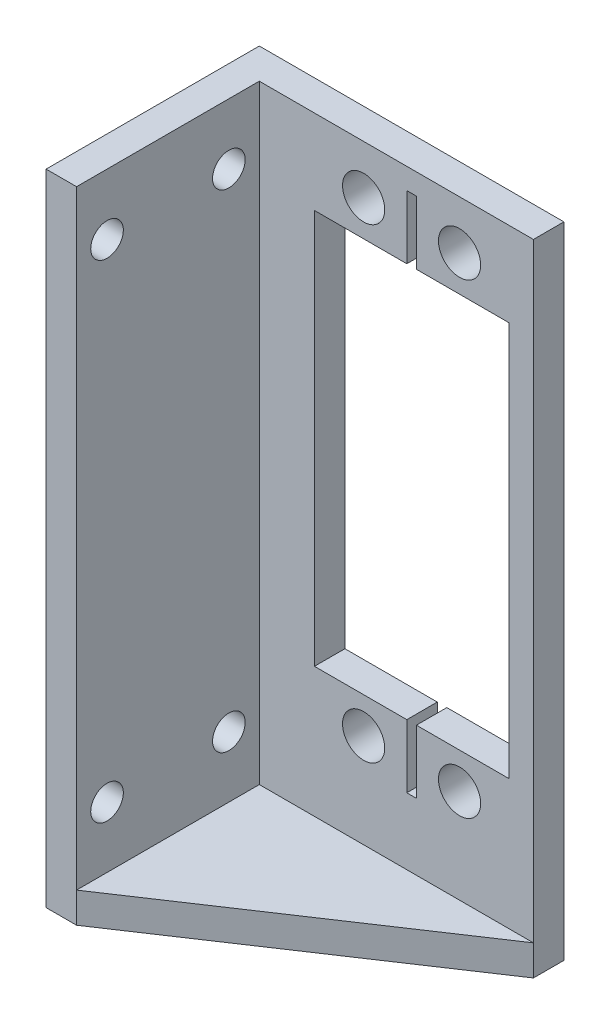
ISO-10303-21;
HEADER;
FILE_DESCRIPTION(('STEP AP214'),'2;1');
FILE_NAME('part.step','',(''),(''),'','','');
FILE_SCHEMA(('AUTOMOTIVE_DESIGN { 1 0 10303 214 1 1 1 1 }'));
ENDSEC;
DATA;
#1=APPLICATION_CONTEXT('core data for automotive mechanical design processes');
#2=APPLICATION_PROTOCOL_DEFINITION('international standard','automotive_design',2000,#1);
#3=PRODUCT_CONTEXT('',#1,'mechanical');
#4=PRODUCT('Part','Part','',(#3));
#5=PRODUCT_RELATED_PRODUCT_CATEGORY('part','',(#4));
#6=PRODUCT_DEFINITION_FORMATION('','',#4);
#7=PRODUCT_DEFINITION_CONTEXT('part definition',#1,'design');
#8=PRODUCT_DEFINITION('design','',#6,#7);
#9=PRODUCT_DEFINITION_SHAPE('','',#8);
#10=(LENGTH_UNIT() NAMED_UNIT(*) SI_UNIT(.MILLI.,.METRE.));
#11=(NAMED_UNIT(*) PLANE_ANGLE_UNIT() SI_UNIT($,.RADIAN.));
#12=(NAMED_UNIT(*) SI_UNIT($,.STERADIAN.) SOLID_ANGLE_UNIT());
#13=UNCERTAINTY_MEASURE_WITH_UNIT(LENGTH_MEASURE(1.E-05),#10,'distance_accuracy_value','');
#14=(GEOMETRIC_REPRESENTATION_CONTEXT(3) GLOBAL_UNCERTAINTY_ASSIGNED_CONTEXT((#13)) GLOBAL_UNIT_ASSIGNED_CONTEXT((#10,
#11,#12)) REPRESENTATION_CONTEXT('',''));
#15=CARTESIAN_POINT('',(0.,0.,0.));
#16=DIRECTION('',(0.,0.,1.));
#17=DIRECTION('',(1.,0.,0.));
#18=AXIS2_PLACEMENT_3D('',#15,#16,#17);
#19=CARTESIAN_POINT('',(31.75,0.,-3.175));
#20=DIRECTION('',(-1.,0.,0.));
#21=DIRECTION('',(0.,-1.,0.));
#22=AXIS2_PLACEMENT_3D('',#19,#20,#21);
#23=PLANE('',#22);
#24=DIRECTION('',(0.,1.,0.));
#25=VECTOR('',#24,1.);
#26=CARTESIAN_POINT('',(31.75,0.,0.));
#27=LINE('',#26,#25);
#28=CARTESIAN_POINT('',(31.75,0.,0.));
#29=VERTEX_POINT('',#28);
#30=CARTESIAN_POINT('',(31.75,63.5,0.));
#31=VERTEX_POINT('',#30);
#32=EDGE_CURVE('E349',#29,#31,#27,.T.);
#33=ORIENTED_EDGE('',*,*,#32,.F.);
#34=DIRECTION('',(0.,1.,0.));
#35=VECTOR('',#34,1.);
#36=CARTESIAN_POINT('',(31.75,-3.175,0.));
#37=LINE('',#36,#35);
#38=CARTESIAN_POINT('',(31.75,-3.175,0.));
#39=VERTEX_POINT('',#38);
#40=EDGE_CURVE('E208',#39,#29,#37,.T.);
#41=ORIENTED_EDGE('',*,*,#40,.F.);
#42=DIRECTION('',(0.,0.,-1.));
#43=VECTOR('',#42,1.);
#44=CARTESIAN_POINT('',(31.75,-3.175,-3.175));
#45=LINE('',#44,#43);
#46=CARTESIAN_POINT('',(31.75,-3.175,-3.175));
#47=VERTEX_POINT('',#46);
#48=EDGE_CURVE('E204',#39,#47,#45,.T.);
#49=ORIENTED_EDGE('',*,*,#48,.T.);
#50=DIRECTION('',(0.,1.,0.));
#51=VECTOR('',#50,1.);
#52=CARTESIAN_POINT('',(31.75,0.,-3.175));
#53=LINE('',#52,#51);
#54=CARTESIAN_POINT('',(31.75,63.5,-3.175));
#55=VERTEX_POINT('',#54);
#56=EDGE_CURVE('E340',#47,#55,#53,.T.);
#57=ORIENTED_EDGE('',*,*,#56,.T.);
#58=DIRECTION('',(0.,0.,1.));
#59=VECTOR('',#58,1.);
#60=CARTESIAN_POINT('',(31.75,63.5,-3.175));
#61=LINE('',#60,#59);
#62=EDGE_CURVE('E11',#55,#31,#61,.T.);
#63=ORIENTED_EDGE('',*,*,#62,.T.);
#64=EDGE_LOOP('',(#33,#41,#49,#57,#63));
#65=FACE_BOUND('',#64,.T.);
#66=ADVANCED_FACE('F39',(#65),#23,.F.);
#67=CARTESIAN_POINT('',(0.,63.5,-3.175));
#68=DIRECTION('',(0.,1.,0.));
#69=DIRECTION('',(0.,0.,-1.));
#70=AXIS2_PLACEMENT_3D('',#67,#68,#69);
#71=PLANE('',#70);
#72=DIRECTION('',(1.,0.,0.));
#73=VECTOR('',#72,1.);
#74=CARTESIAN_POINT('',(0.,63.5,0.));
#75=LINE('',#74,#73);
#76=CARTESIAN_POINT('',(3.175,63.5,0.));
#77=VERTEX_POINT('',#76);
#78=EDGE_CURVE('E344',#77,#31,#75,.T.);
#79=ORIENTED_EDGE('',*,*,#78,.T.);
#80=ORIENTED_EDGE('',*,*,#62,.F.);
#81=DIRECTION('',(1.,0.,0.));
#82=VECTOR('',#81,1.);
#83=CARTESIAN_POINT('',(0.,63.5,-3.175));
#84=LINE('',#83,#82);
#85=CARTESIAN_POINT('',(0.,63.5,-3.175));
#86=VERTEX_POINT('',#85);
#87=EDGE_CURVE('E343',#86,#55,#84,.T.);
#88=ORIENTED_EDGE('',*,*,#87,.F.);
#89=DIRECTION('',(0.,0.,1.));
#90=VECTOR('',#89,1.);
#91=CARTESIAN_POINT('',(0.,63.5,-3.175));
#92=LINE('',#91,#90);
#93=CARTESIAN_POINT('',(0.,63.5,19.05));
#94=VERTEX_POINT('',#93);
#95=EDGE_CURVE('E46',#86,#94,#92,.T.);
#96=ORIENTED_EDGE('',*,*,#95,.T.);
#97=DIRECTION('',(-1.,0.,0.));
#98=VECTOR('',#97,1.);
#99=CARTESIAN_POINT('',(0.,63.5,19.05));
#100=LINE('',#99,#98);
#101=CARTESIAN_POINT('',(3.175,63.5,19.05));
#102=VERTEX_POINT('',#101);
#103=EDGE_CURVE('E187',#102,#94,#100,.T.);
#104=ORIENTED_EDGE('',*,*,#103,.F.);
#105=DIRECTION('',(0.,0.,-1.));
#106=VECTOR('',#105,1.);
#107=CARTESIAN_POINT('',(3.175,63.5,19.05));
#108=LINE('',#107,#106);
#109=EDGE_CURVE('E218',#102,#77,#108,.T.);
#110=ORIENTED_EDGE('',*,*,#109,.T.);
#111=EDGE_LOOP('',(#79,#80,#88,#96,#104,#110));
#112=FACE_BOUND('',#111,.T.);
#113=ADVANCED_FACE('F354',(#112),#71,.T.);
#114=CARTESIAN_POINT('',(0.,0.,-3.175));
#115=DIRECTION('',(-1.,0.,0.));
#116=DIRECTION('',(0.,-1.,0.));
#117=AXIS2_PLACEMENT_3D('',#114,#115,#116);
#118=PLANE('',#117);
#119=CARTESIAN_POINT('',(0.,6.35,3.175));
#120=DIRECTION('',(-1.,0.,0.));
#121=DIRECTION('',(0.,1.,0.));
#122=AXIS2_PLACEMENT_3D('',#119,#120,#121);
#123=CIRCLE('',#122,1.700000029);
#124=CARTESIAN_POINT('',(0.,8.050000029,3.175));
#125=VERTEX_POINT('',#124);
#126=EDGE_CURVE('E402',#125,#125,#123,.T.);
#127=ORIENTED_EDGE('',*,*,#126,.F.);
#128=EDGE_LOOP('',(#127));
#129=FACE_BOUND('',#128,.T.);
#130=CARTESIAN_POINT('',(0.,57.15,15.875));
#131=DIRECTION('',(-1.,0.,0.));
#132=DIRECTION('',(0.,1.,0.));
#133=AXIS2_PLACEMENT_3D('',#130,#131,#132);
#134=CIRCLE('',#133,1.700000029);
#135=CARTESIAN_POINT('',(0.,58.850000029,15.875));
#136=VERTEX_POINT('',#135);
#137=EDGE_CURVE('E406',#136,#136,#134,.T.);
#138=ORIENTED_EDGE('',*,*,#137,.F.);
#139=EDGE_LOOP('',(#138));
#140=FACE_BOUND('',#139,.T.);
#141=CARTESIAN_POINT('',(0.,6.35,15.875));
#142=DIRECTION('',(-1.,0.,0.));
#143=DIRECTION('',(0.,1.,0.));
#144=AXIS2_PLACEMENT_3D('',#141,#142,#143);
#145=CIRCLE('',#144,1.700000029);
#146=CARTESIAN_POINT('',(0.,8.050000029,15.875));
#147=VERTEX_POINT('',#146);
#148=EDGE_CURVE('E410',#147,#147,#145,.T.);
#149=ORIENTED_EDGE('',*,*,#148,.F.);
#150=EDGE_LOOP('',(#149));
#151=FACE_BOUND('',#150,.T.);
#152=CARTESIAN_POINT('',(0.,57.15,3.175));
#153=DIRECTION('',(-1.,0.,0.));
#154=DIRECTION('',(0.,1.,0.));
#155=AXIS2_PLACEMENT_3D('',#152,#153,#154);
#156=CIRCLE('',#155,1.700000029);
#157=CARTESIAN_POINT('',(0.,58.850000029,3.175));
#158=VERTEX_POINT('',#157);
#159=EDGE_CURVE('E197',#158,#158,#156,.T.);
#160=ORIENTED_EDGE('',*,*,#159,.F.);
#161=EDGE_LOOP('',(#160));
#162=FACE_BOUND('',#161,.T.);
#163=ORIENTED_EDGE('',*,*,#95,.F.);
#164=DIRECTION('',(0.,1.,0.));
#165=VECTOR('',#164,1.);
#166=CARTESIAN_POINT('',(0.,0.,-3.175));
#167=LINE('',#166,#165);
#168=CARTESIAN_POINT('',(0.,-3.175,-3.175));
#169=VERTEX_POINT('',#168);
#170=EDGE_CURVE('E194',#169,#86,#167,.T.);
#171=ORIENTED_EDGE('',*,*,#170,.F.);
#172=DIRECTION('',(0.,0.,1.));
#173=VECTOR('',#172,1.);
#174=CARTESIAN_POINT('',(0.,-3.175,19.05));
#175=LINE('',#174,#173);
#176=CARTESIAN_POINT('',(0.,-3.175,19.05));
#177=VERTEX_POINT('',#176);
#178=EDGE_CURVE('E175',#169,#177,#175,.T.);
#179=ORIENTED_EDGE('',*,*,#178,.T.);
#180=DIRECTION('',(0.,-1.,0.));
#181=VECTOR('',#180,1.);
#182=CARTESIAN_POINT('',(0.,0.,19.05));
#183=LINE('',#182,#181);
#184=EDGE_CURVE('E184',#94,#177,#183,.T.);
#185=ORIENTED_EDGE('',*,*,#184,.F.);
#186=EDGE_LOOP('',(#163,#171,#179,#185));
#187=FACE_BOUND('',#186,.T.);
#188=ADVANCED_FACE('F193',(#129,#140,#151,#162,#187),#118,.T.);
#189=CARTESIAN_POINT('',(0.,0.,-3.175));
#190=DIRECTION('',(0.,0.,-1.));
#191=DIRECTION('',(1.,0.,0.));
#192=AXIS2_PLACEMENT_3D('',#189,#190,#191);
#193=PLANE('',#192);
#194=CARTESIAN_POINT('',(24.050000033,9.82700003100002,-3.175));
#195=DIRECTION('',(0.,0.,1.));
#196=DIRECTION('',(1.,0.,0.));
#197=AXIS2_PLACEMENT_3D('',#194,#195,#196);
#198=CIRCLE('',#197,2.200000045);
#199=CARTESIAN_POINT('',(26.250000078,9.82700003100002,-3.175));
#200=VERTEX_POINT('',#199);
#201=EDGE_CURVE('E322',#200,#200,#198,.T.);
#202=ORIENTED_EDGE('',*,*,#201,.T.);
#203=EDGE_LOOP('',(#202));
#204=FACE_BOUND('',#203,.T.);
#205=CARTESIAN_POINT('',(14.049999967,58.427000113,-3.175));
#206=DIRECTION('',(0.,0.,1.));
#207=DIRECTION('',(1.,0.,0.));
#208=AXIS2_PLACEMENT_3D('',#205,#206,#207);
#209=CIRCLE('',#208,2.200000045);
#210=CARTESIAN_POINT('',(16.250000012,58.427000113,-3.175));
#211=VERTEX_POINT('',#210);
#212=EDGE_CURVE('E329',#211,#211,#209,.T.);
#213=ORIENTED_EDGE('',*,*,#212,.T.);
#214=EDGE_LOOP('',(#213));
#215=FACE_BOUND('',#214,.T.);
#216=DIRECTION('',(0.,-1.,0.));
#217=VECTOR('',#216,1.);
#218=CARTESIAN_POINT('',(8.923000061,54.704000066,-3.175));
#219=LINE('',#218,#217);
#220=CARTESIAN_POINT('',(8.923000061,54.704000066,-3.175));
#221=VERTEX_POINT('',#220);
#222=CARTESIAN_POINT('',(8.923000061,13.550000078,-3.175));
#223=VERTEX_POINT('',#222);
#224=EDGE_CURVE('E279',#221,#223,#219,.T.);
#225=ORIENTED_EDGE('',*,*,#224,.T.);
#226=DIRECTION('',(1.,0.,0.));
#227=VECTOR('',#226,1.);
#228=CARTESIAN_POINT('',(8.923000061,13.550000078,-3.175));
#229=LINE('',#228,#227);
#230=CARTESIAN_POINT('',(18.55,13.550000078,-3.175));
#231=VERTEX_POINT('',#230);
#232=EDGE_CURVE('E276',#223,#231,#229,.T.);
#233=ORIENTED_EDGE('',*,*,#232,.T.);
#234=DIRECTION('',(0.,-1.,0.));
#235=VECTOR('',#234,1.);
#236=CARTESIAN_POINT('',(18.55,13.550000078,-3.175));
#237=LINE('',#236,#235);
#238=CARTESIAN_POINT('',(18.55,6.94600007800004,-3.175));
#239=VERTEX_POINT('',#238);
#240=EDGE_CURVE('E273',#231,#239,#237,.T.);
#241=ORIENTED_EDGE('',*,*,#240,.T.);
#242=DIRECTION('',(1.,0.,0.));
#243=VECTOR('',#242,1.);
#244=CARTESIAN_POINT('',(18.55,6.94600007800004,-3.175));
#245=LINE('',#244,#243);
#246=CARTESIAN_POINT('',(19.55,6.94600007800001,-3.175));
#247=VERTEX_POINT('',#246);
#248=EDGE_CURVE('E270',#239,#247,#245,.T.);
#249=ORIENTED_EDGE('',*,*,#248,.T.);
#250=DIRECTION('',(0.,1.,0.));
#251=VECTOR('',#250,1.);
#252=CARTESIAN_POINT('',(19.55,13.550000078,-3.175));
#253=LINE('',#252,#251);
#254=CARTESIAN_POINT('',(19.55,13.550000078,-3.175));
#255=VERTEX_POINT('',#254);
#256=EDGE_CURVE('E267',#247,#255,#253,.T.);
#257=ORIENTED_EDGE('',*,*,#256,.T.);
#258=DIRECTION('',(1.,0.,0.));
#259=VECTOR('',#258,1.);
#260=CARTESIAN_POINT('',(19.55,13.550000078,-3.175));
#261=LINE('',#260,#259);
#262=CARTESIAN_POINT('',(29.176999939,13.550000078,-3.175));
#263=VERTEX_POINT('',#262);
#264=EDGE_CURVE('E264',#255,#263,#261,.T.);
#265=ORIENTED_EDGE('',*,*,#264,.T.);
#266=DIRECTION('',(0.,1.,0.));
#267=VECTOR('',#266,1.);
#268=CARTESIAN_POINT('',(29.176999939,54.704000066,-3.175));
#269=LINE('',#268,#267);
#270=CARTESIAN_POINT('',(29.176999939,54.704000066,-3.175));
#271=VERTEX_POINT('',#270);
#272=EDGE_CURVE('E261',#263,#271,#269,.T.);
#273=ORIENTED_EDGE('',*,*,#272,.T.);
#274=DIRECTION('',(-1.,0.,0.));
#275=VECTOR('',#274,1.);
#276=CARTESIAN_POINT('',(19.55,54.704000066,-3.175));
#277=LINE('',#276,#275);
#278=CARTESIAN_POINT('',(19.55,54.704000066,-3.175));
#279=VERTEX_POINT('',#278);
#280=EDGE_CURVE('E258',#271,#279,#277,.T.);
#281=ORIENTED_EDGE('',*,*,#280,.T.);
#282=DIRECTION('',(0.,1.,0.));
#283=VECTOR('',#282,1.);
#284=CARTESIAN_POINT('',(19.55,54.704000066,-3.175));
#285=LINE('',#284,#283);
#286=CARTESIAN_POINT('',(19.55,61.308000066,-3.175));
#287=VERTEX_POINT('',#286);
#288=EDGE_CURVE('E255',#279,#287,#285,.T.);
#289=ORIENTED_EDGE('',*,*,#288,.T.);
#290=DIRECTION('',(-1.,0.,0.));
#291=VECTOR('',#290,1.);
#292=CARTESIAN_POINT('',(18.55,61.308000066,-3.175));
#293=LINE('',#292,#291);
#294=CARTESIAN_POINT('',(18.55,61.308000066,-3.175));
#295=VERTEX_POINT('',#294);
#296=EDGE_CURVE('E252',#287,#295,#293,.T.);
#297=ORIENTED_EDGE('',*,*,#296,.T.);
#298=DIRECTION('',(0.,-1.,0.));
#299=VECTOR('',#298,1.);
#300=CARTESIAN_POINT('',(18.55,54.704000066,-3.175));
#301=LINE('',#300,#299);
#302=CARTESIAN_POINT('',(18.55,54.704000066,-3.175));
#303=VERTEX_POINT('',#302);
#304=EDGE_CURVE('E248',#295,#303,#301,.T.);
#305=ORIENTED_EDGE('',*,*,#304,.T.);
#306=DIRECTION('',(-1.,0.,0.));
#307=VECTOR('',#306,1.);
#308=CARTESIAN_POINT('',(8.923000061,54.704000066,-3.175));
#309=LINE('',#308,#307);
#310=EDGE_CURVE('E245',#303,#221,#309,.T.);
#311=ORIENTED_EDGE('',*,*,#310,.T.);
#312=EDGE_LOOP('',(#225,#233,#241,#249,#257,#265,#273,#281,#289,#297,#305,#311));
#313=FACE_BOUND('',#312,.T.);
#314=CARTESIAN_POINT('',(24.050000033,58.427000113,-3.175));
#315=DIRECTION('',(0.,0.,1.));
#316=DIRECTION('',(1.,0.,0.));
#317=AXIS2_PLACEMENT_3D('',#314,#315,#316);
#318=CIRCLE('',#317,2.200000045);
#319=CARTESIAN_POINT('',(26.250000078,58.427000113,-3.175));
#320=VERTEX_POINT('',#319);
#321=EDGE_CURVE('E316',#320,#320,#318,.T.);
#322=ORIENTED_EDGE('',*,*,#321,.T.);
#323=EDGE_LOOP('',(#322));
#324=FACE_BOUND('',#323,.T.);
#325=CARTESIAN_POINT('',(14.049999967,9.82700003100002,-3.175));
#326=DIRECTION('',(0.,0.,1.));
#327=DIRECTION('',(1.,0.,0.));
#328=AXIS2_PLACEMENT_3D('',#325,#326,#327);
#329=CIRCLE('',#328,2.200000045);
#330=CARTESIAN_POINT('',(16.250000012,9.82700003100002,-3.175));
#331=VERTEX_POINT('',#330);
#332=EDGE_CURVE('E325',#331,#331,#329,.T.);
#333=ORIENTED_EDGE('',*,*,#332,.T.);
#334=EDGE_LOOP('',(#333));
#335=FACE_BOUND('',#334,.T.);
#336=ORIENTED_EDGE('',*,*,#170,.T.);
#337=ORIENTED_EDGE('',*,*,#87,.T.);
#338=ORIENTED_EDGE('',*,*,#56,.F.);
#339=DIRECTION('',(-1.,0.,0.));
#340=VECTOR('',#339,1.);
#341=CARTESIAN_POINT('',(0.,-3.175,-3.175));
#342=LINE('',#341,#340);
#343=EDGE_CURVE('E207',#47,#169,#342,.T.);
#344=ORIENTED_EDGE('',*,*,#343,.T.);
#345=EDGE_LOOP('',(#336,#337,#338,#344));
#346=FACE_BOUND('',#345,.T.);
#347=ADVANCED_FACE('F358',(#204,#215,#313,#324,#335,#346),#193,.T.);
#348=CARTESIAN_POINT('',(0.,0.,0.));
#349=DIRECTION('',(0.,0.,-1.));
#350=DIRECTION('',(1.,0.,0.));
#351=AXIS2_PLACEMENT_3D('',#348,#349,#350);
#352=PLANE('',#351);
#353=CARTESIAN_POINT('',(24.050000033,9.82700003100002,0.));
#354=DIRECTION('',(0.,0.,1.));
#355=DIRECTION('',(1.,0.,0.));
#356=AXIS2_PLACEMENT_3D('',#353,#354,#355);
#357=CIRCLE('',#356,2.200000045);
#358=CARTESIAN_POINT('',(26.250000078,9.82700003100002,0.));
#359=VERTEX_POINT('',#358);
#360=EDGE_CURVE('E326',#359,#359,#357,.T.);
#361=ORIENTED_EDGE('',*,*,#360,.F.);
#362=EDGE_LOOP('',(#361));
#363=FACE_BOUND('',#362,.T.);
#364=CARTESIAN_POINT('',(14.049999967,58.427000113,0.));
#365=DIRECTION('',(0.,0.,1.));
#366=DIRECTION('',(1.,0.,0.));
#367=AXIS2_PLACEMENT_3D('',#364,#365,#366);
#368=CIRCLE('',#367,2.200000045);
#369=CARTESIAN_POINT('',(16.250000012,58.427000113,0.));
#370=VERTEX_POINT('',#369);
#371=EDGE_CURVE('E319',#370,#370,#368,.T.);
#372=ORIENTED_EDGE('',*,*,#371,.F.);
#373=EDGE_LOOP('',(#372));
#374=FACE_BOUND('',#373,.T.);
#375=DIRECTION('',(-1.,0.,0.));
#376=VECTOR('',#375,1.);
#377=CARTESIAN_POINT('',(8.923000061,54.704000066,0.));
#378=LINE('',#377,#376);
#379=CARTESIAN_POINT('',(18.55,54.704000066,0.));
#380=VERTEX_POINT('',#379);
#381=CARTESIAN_POINT('',(8.923000061,54.704000066,0.));
#382=VERTEX_POINT('',#381);
#383=EDGE_CURVE('E223',#380,#382,#378,.T.);
#384=ORIENTED_EDGE('',*,*,#383,.F.);
#385=DIRECTION('',(0.,-1.,0.));
#386=VECTOR('',#385,1.);
#387=CARTESIAN_POINT('',(18.55,54.704000066,0.));
#388=LINE('',#387,#386);
#389=CARTESIAN_POINT('',(18.55,61.308000066,0.));
#390=VERTEX_POINT('',#389);
#391=EDGE_CURVE('E285',#390,#380,#388,.T.);
#392=ORIENTED_EDGE('',*,*,#391,.F.);
#393=DIRECTION('',(-1.,0.,0.));
#394=VECTOR('',#393,1.);
#395=CARTESIAN_POINT('',(18.55,61.308000066,0.));
#396=LINE('',#395,#394);
#397=CARTESIAN_POINT('',(19.55,61.308000066,0.));
#398=VERTEX_POINT('',#397);
#399=EDGE_CURVE('E288',#398,#390,#396,.T.);
#400=ORIENTED_EDGE('',*,*,#399,.F.);
#401=DIRECTION('',(0.,1.,0.));
#402=VECTOR('',#401,1.);
#403=CARTESIAN_POINT('',(19.55,54.704000066,0.));
#404=LINE('',#403,#402);
#405=CARTESIAN_POINT('',(19.55,54.704000066,0.));
#406=VERTEX_POINT('',#405);
#407=EDGE_CURVE('E291',#406,#398,#404,.T.);
#408=ORIENTED_EDGE('',*,*,#407,.F.);
#409=DIRECTION('',(-1.,0.,0.));
#410=VECTOR('',#409,1.);
#411=CARTESIAN_POINT('',(19.55,54.704000066,0.));
#412=LINE('',#411,#410);
#413=CARTESIAN_POINT('',(29.176999939,54.704000066,0.));
#414=VERTEX_POINT('',#413);
#415=EDGE_CURVE('E294',#414,#406,#412,.T.);
#416=ORIENTED_EDGE('',*,*,#415,.F.);
#417=DIRECTION('',(0.,1.,0.));
#418=VECTOR('',#417,1.);
#419=CARTESIAN_POINT('',(29.176999939,54.704000066,0.));
#420=LINE('',#419,#418);
#421=CARTESIAN_POINT('',(29.176999939,13.550000078,0.));
#422=VERTEX_POINT('',#421);
#423=EDGE_CURVE('E297',#422,#414,#420,.T.);
#424=ORIENTED_EDGE('',*,*,#423,.F.);
#425=DIRECTION('',(1.,0.,0.));
#426=VECTOR('',#425,1.);
#427=CARTESIAN_POINT('',(19.55,13.550000078,0.));
#428=LINE('',#427,#426);
#429=CARTESIAN_POINT('',(19.55,13.550000078,0.));
#430=VERTEX_POINT('',#429);
#431=EDGE_CURVE('E300',#430,#422,#428,.T.);
#432=ORIENTED_EDGE('',*,*,#431,.F.);
#433=DIRECTION('',(0.,1.,0.));
#434=VECTOR('',#433,1.);
#435=CARTESIAN_POINT('',(19.55,13.550000078,0.));
#436=LINE('',#435,#434);
#437=CARTESIAN_POINT('',(19.55,6.94600007800001,0.));
#438=VERTEX_POINT('',#437);
#439=EDGE_CURVE('E303',#438,#430,#436,.T.);
#440=ORIENTED_EDGE('',*,*,#439,.F.);
#441=DIRECTION('',(1.,0.,0.));
#442=VECTOR('',#441,1.);
#443=CARTESIAN_POINT('',(18.55,6.94600007800004,0.));
#444=LINE('',#443,#442);
#445=CARTESIAN_POINT('',(18.55,6.94600007800004,0.));
#446=VERTEX_POINT('',#445);
#447=EDGE_CURVE('E306',#446,#438,#444,.T.);
#448=ORIENTED_EDGE('',*,*,#447,.F.);
#449=DIRECTION('',(0.,-1.,0.));
#450=VECTOR('',#449,1.);
#451=CARTESIAN_POINT('',(18.55,13.550000078,0.));
#452=LINE('',#451,#450);
#453=CARTESIAN_POINT('',(18.55,13.550000078,0.));
#454=VERTEX_POINT('',#453);
#455=EDGE_CURVE('E309',#454,#446,#452,.T.);
#456=ORIENTED_EDGE('',*,*,#455,.F.);
#457=DIRECTION('',(1.,0.,0.));
#458=VECTOR('',#457,1.);
#459=CARTESIAN_POINT('',(8.923000061,13.550000078,0.));
#460=LINE('',#459,#458);
#461=CARTESIAN_POINT('',(8.923000061,13.550000078,0.));
#462=VERTEX_POINT('',#461);
#463=EDGE_CURVE('E312',#462,#454,#460,.T.);
#464=ORIENTED_EDGE('',*,*,#463,.F.);
#465=DIRECTION('',(0.,-1.,0.));
#466=VECTOR('',#465,1.);
#467=CARTESIAN_POINT('',(8.923000061,54.704000066,0.));
#468=LINE('',#467,#466);
#469=EDGE_CURVE('E249',#382,#462,#468,.T.);
#470=ORIENTED_EDGE('',*,*,#469,.F.);
#471=EDGE_LOOP('',(#384,#392,#400,#408,#416,#424,#432,#440,#448,#456,#464,#470));
#472=FACE_BOUND('',#471,.T.);
#473=CARTESIAN_POINT('',(24.050000033,58.427000113,0.));
#474=DIRECTION('',(0.,0.,1.));
#475=DIRECTION('',(1.,0.,0.));
#476=AXIS2_PLACEMENT_3D('',#473,#474,#475);
#477=CIRCLE('',#476,2.200000045);
#478=CARTESIAN_POINT('',(26.250000078,58.427000113,0.));
#479=VERTEX_POINT('',#478);
#480=EDGE_CURVE('E282',#479,#479,#477,.T.);
#481=ORIENTED_EDGE('',*,*,#480,.F.);
#482=EDGE_LOOP('',(#481));
#483=FACE_BOUND('',#482,.T.);
#484=CARTESIAN_POINT('',(14.049999967,9.82700003100002,0.));
#485=DIRECTION('',(0.,0.,1.));
#486=DIRECTION('',(1.,0.,0.));
#487=AXIS2_PLACEMENT_3D('',#484,#485,#486);
#488=CIRCLE('',#487,2.200000045);
#489=CARTESIAN_POINT('',(16.250000012,9.82700003100002,0.));
#490=VERTEX_POINT('',#489);
#491=EDGE_CURVE('E334',#490,#490,#488,.T.);
#492=ORIENTED_EDGE('',*,*,#491,.F.);
#493=EDGE_LOOP('',(#492));
#494=FACE_BOUND('',#493,.T.);
#495=DIRECTION('',(1.,0.,0.));
#496=VECTOR('',#495,1.);
#497=CARTESIAN_POINT('',(0.,0.,0.));
#498=LINE('',#497,#496);
#499=CARTESIAN_POINT('',(3.17500000000001,0.,0.));
#500=VERTEX_POINT('',#499);
#501=EDGE_CURVE('E337',#500,#29,#498,.T.);
#502=ORIENTED_EDGE('',*,*,#501,.T.);
#503=ORIENTED_EDGE('',*,*,#32,.T.);
#504=ORIENTED_EDGE('',*,*,#78,.F.);
#505=DIRECTION('',(0.,1.,0.));
#506=VECTOR('',#505,1.);
#507=CARTESIAN_POINT('',(3.17500000000001,0.,0.));
#508=LINE('',#507,#506);
#509=EDGE_CURVE('E53',#500,#77,#508,.T.);
#510=ORIENTED_EDGE('',*,*,#509,.F.);
#511=EDGE_LOOP('',(#502,#503,#504,#510));
#512=FACE_BOUND('',#511,.T.);
#513=ADVANCED_FACE('F372',(#363,#374,#472,#483,#494,#512),#352,.F.);
#514=CARTESIAN_POINT('',(14.049999967,9.82700003100002,0.));
#515=DIRECTION('',(0.,0.,-1.));
#516=DIRECTION('',(1.,0.,0.));
#517=AXIS2_PLACEMENT_3D('',#514,#515,#516);
#518=CYLINDRICAL_SURFACE('',#517,2.200000045);
#519=ORIENTED_EDGE('',*,*,#491,.T.);
#520=EDGE_LOOP('',(#519));
#521=FACE_BOUND('',#520,.T.);
#522=ORIENTED_EDGE('',*,*,#332,.F.);
#523=EDGE_LOOP('',(#522));
#524=FACE_BOUND('',#523,.T.);
#525=ADVANCED_FACE('F374',(#521,#524),#518,.F.);
#526=CARTESIAN_POINT('',(24.050000033,58.427000113,0.));
#527=DIRECTION('',(0.,0.,-1.));
#528=DIRECTION('',(1.,0.,0.));
#529=AXIS2_PLACEMENT_3D('',#526,#527,#528);
#530=CYLINDRICAL_SURFACE('',#529,2.200000045);
#531=ORIENTED_EDGE('',*,*,#480,.T.);
#532=EDGE_LOOP('',(#531));
#533=FACE_BOUND('',#532,.T.);
#534=ORIENTED_EDGE('',*,*,#321,.F.);
#535=EDGE_LOOP('',(#534));
#536=FACE_BOUND('',#535,.T.);
#537=ADVANCED_FACE('F381',(#533,#536),#530,.F.);
#538=CARTESIAN_POINT('',(8.923000061,54.704000066,0.));
#539=DIRECTION('',(-1.,0.,0.));
#540=DIRECTION('',(0.,0.,-1.));
#541=AXIS2_PLACEMENT_3D('',#538,#539,#540);
#542=PLANE('',#541);
#543=ORIENTED_EDGE('',*,*,#224,.F.);
#544=DIRECTION('',(0.,0.,-1.));
#545=VECTOR('',#544,1.);
#546=CARTESIAN_POINT('',(8.923000061,54.704000066,0.));
#547=LINE('',#546,#545);
#548=EDGE_CURVE('E220',#382,#221,#547,.T.);
#549=ORIENTED_EDGE('',*,*,#548,.F.);
#550=ORIENTED_EDGE('',*,*,#469,.T.);
#551=DIRECTION('',(0.,0.,-1.));
#552=VECTOR('',#551,1.);
#553=CARTESIAN_POINT('',(8.923000061,13.550000078,0.));
#554=LINE('',#553,#552);
#555=EDGE_CURVE('E61',#462,#223,#554,.T.);
#556=ORIENTED_EDGE('',*,*,#555,.T.);
#557=EDGE_LOOP('',(#543,#549,#550,#556));
#558=FACE_BOUND('',#557,.T.);
#559=ADVANCED_FACE('F461',(#558),#542,.F.);
#560=CARTESIAN_POINT('',(8.923000061,54.704000066,0.));
#561=DIRECTION('',(0.,1.,0.));
#562=DIRECTION('',(0.,0.,-1.));
#563=AXIS2_PLACEMENT_3D('',#560,#561,#562);
#564=PLANE('',#563);
#565=ORIENTED_EDGE('',*,*,#310,.F.);
#566=DIRECTION('',(0.,0.,-1.));
#567=VECTOR('',#566,1.);
#568=CARTESIAN_POINT('',(18.55,54.704000066,0.));
#569=LINE('',#568,#567);
#570=EDGE_CURVE('E242',#380,#303,#569,.T.);
#571=ORIENTED_EDGE('',*,*,#570,.F.);
#572=ORIENTED_EDGE('',*,*,#383,.T.);
#573=ORIENTED_EDGE('',*,*,#548,.T.);
#574=EDGE_LOOP('',(#565,#571,#572,#573));
#575=FACE_BOUND('',#574,.T.);
#576=ADVANCED_FACE('F464',(#575),#564,.F.);
#577=CARTESIAN_POINT('',(18.55,54.704000066,0.));
#578=DIRECTION('',(-1.,0.,0.));
#579=DIRECTION('',(0.,0.,-1.));
#580=AXIS2_PLACEMENT_3D('',#577,#578,#579);
#581=PLANE('',#580);
#582=ORIENTED_EDGE('',*,*,#304,.F.);
#583=DIRECTION('',(0.,0.,-1.));
#584=VECTOR('',#583,1.);
#585=CARTESIAN_POINT('',(18.55,61.308000066,0.));
#586=LINE('',#585,#584);
#587=EDGE_CURVE('E240',#390,#295,#586,.T.);
#588=ORIENTED_EDGE('',*,*,#587,.F.);
#589=ORIENTED_EDGE('',*,*,#391,.T.);
#590=ORIENTED_EDGE('',*,*,#570,.T.);
#591=EDGE_LOOP('',(#582,#588,#589,#590));
#592=FACE_BOUND('',#591,.T.);
#593=ADVANCED_FACE('F501',(#592),#581,.F.);
#594=CARTESIAN_POINT('',(18.55,61.308000066,0.));
#595=DIRECTION('',(0.,1.,0.));
#596=DIRECTION('',(0.,0.,-1.));
#597=AXIS2_PLACEMENT_3D('',#594,#595,#596);
#598=PLANE('',#597);
#599=ORIENTED_EDGE('',*,*,#296,.F.);
#600=DIRECTION('',(0.,0.,-1.));
#601=VECTOR('',#600,1.);
#602=CARTESIAN_POINT('',(19.55,61.308000066,0.));
#603=LINE('',#602,#601);
#604=EDGE_CURVE('E238',#398,#287,#603,.T.);
#605=ORIENTED_EDGE('',*,*,#604,.F.);
#606=ORIENTED_EDGE('',*,*,#399,.T.);
#607=ORIENTED_EDGE('',*,*,#587,.T.);
#608=EDGE_LOOP('',(#599,#605,#606,#607));
#609=FACE_BOUND('',#608,.T.);
#610=ADVANCED_FACE('F497',(#609),#598,.F.);
#611=CARTESIAN_POINT('',(19.55,54.704000066,0.));
#612=DIRECTION('',(1.,0.,0.));
#613=DIRECTION('',(0.,0.,1.));
#614=AXIS2_PLACEMENT_3D('',#611,#612,#613);
#615=PLANE('',#614);
#616=ORIENTED_EDGE('',*,*,#288,.F.);
#617=DIRECTION('',(0.,0.,-1.));
#618=VECTOR('',#617,1.);
#619=CARTESIAN_POINT('',(19.55,54.704000066,0.));
#620=LINE('',#619,#618);
#621=EDGE_CURVE('E236',#406,#279,#620,.T.);
#622=ORIENTED_EDGE('',*,*,#621,.F.);
#623=ORIENTED_EDGE('',*,*,#407,.T.);
#624=ORIENTED_EDGE('',*,*,#604,.T.);
#625=EDGE_LOOP('',(#616,#622,#623,#624));
#626=FACE_BOUND('',#625,.T.);
#627=ADVANCED_FACE('F493',(#626),#615,.F.);
#628=CARTESIAN_POINT('',(19.55,54.704000066,0.));
#629=DIRECTION('',(0.,1.,0.));
#630=DIRECTION('',(0.,0.,-1.));
#631=AXIS2_PLACEMENT_3D('',#628,#629,#630);
#632=PLANE('',#631);
#633=ORIENTED_EDGE('',*,*,#280,.F.);
#634=DIRECTION('',(0.,0.,-1.));
#635=VECTOR('',#634,1.);
#636=CARTESIAN_POINT('',(29.176999939,54.704000066,0.));
#637=LINE('',#636,#635);
#638=EDGE_CURVE('E234',#414,#271,#637,.T.);
#639=ORIENTED_EDGE('',*,*,#638,.F.);
#640=ORIENTED_EDGE('',*,*,#415,.T.);
#641=ORIENTED_EDGE('',*,*,#621,.T.);
#642=EDGE_LOOP('',(#633,#639,#640,#641));
#643=FACE_BOUND('',#642,.T.);
#644=ADVANCED_FACE('F489',(#643),#632,.F.);
#645=CARTESIAN_POINT('',(29.176999939,54.704000066,0.));
#646=DIRECTION('',(1.,0.,0.));
#647=DIRECTION('',(0.,0.,1.));
#648=AXIS2_PLACEMENT_3D('',#645,#646,#647);
#649=PLANE('',#648);
#650=ORIENTED_EDGE('',*,*,#272,.F.);
#651=DIRECTION('',(0.,0.,-1.));
#652=VECTOR('',#651,1.);
#653=CARTESIAN_POINT('',(29.176999939,13.550000078,0.));
#654=LINE('',#653,#652);
#655=EDGE_CURVE('E232',#422,#263,#654,.T.);
#656=ORIENTED_EDGE('',*,*,#655,.F.);
#657=ORIENTED_EDGE('',*,*,#423,.T.);
#658=ORIENTED_EDGE('',*,*,#638,.T.);
#659=EDGE_LOOP('',(#650,#656,#657,#658));
#660=FACE_BOUND('',#659,.T.);
#661=ADVANCED_FACE('F485',(#660),#649,.F.);
#662=CARTESIAN_POINT('',(19.55,13.550000078,0.));
#663=DIRECTION('',(0.,-1.,0.));
#664=DIRECTION('',(0.,0.,1.));
#665=AXIS2_PLACEMENT_3D('',#662,#663,#664);
#666=PLANE('',#665);
#667=ORIENTED_EDGE('',*,*,#264,.F.);
#668=DIRECTION('',(0.,0.,-1.));
#669=VECTOR('',#668,1.);
#670=CARTESIAN_POINT('',(19.55,13.550000078,0.));
#671=LINE('',#670,#669);
#672=EDGE_CURVE('E230',#430,#255,#671,.T.);
#673=ORIENTED_EDGE('',*,*,#672,.F.);
#674=ORIENTED_EDGE('',*,*,#431,.T.);
#675=ORIENTED_EDGE('',*,*,#655,.T.);
#676=EDGE_LOOP('',(#667,#673,#674,#675));
#677=FACE_BOUND('',#676,.T.);
#678=ADVANCED_FACE('F481',(#677),#666,.F.);
#679=CARTESIAN_POINT('',(19.55,13.550000078,0.));
#680=DIRECTION('',(1.,0.,0.));
#681=DIRECTION('',(0.,1.,0.));
#682=AXIS2_PLACEMENT_3D('',#679,#680,#681);
#683=PLANE('',#682);
#684=ORIENTED_EDGE('',*,*,#256,.F.);
#685=DIRECTION('',(0.,0.,-1.));
#686=VECTOR('',#685,1.);
#687=CARTESIAN_POINT('',(19.55,6.94600007800001,0.));
#688=LINE('',#687,#686);
#689=EDGE_CURVE('E228',#438,#247,#688,.T.);
#690=ORIENTED_EDGE('',*,*,#689,.F.);
#691=ORIENTED_EDGE('',*,*,#439,.T.);
#692=ORIENTED_EDGE('',*,*,#672,.T.);
#693=EDGE_LOOP('',(#684,#690,#691,#692));
#694=FACE_BOUND('',#693,.T.);
#695=ADVANCED_FACE('F477',(#694),#683,.F.);
#696=CARTESIAN_POINT('',(18.55,6.94600007800004,0.));
#697=DIRECTION('',(0.,-1.,0.));
#698=DIRECTION('',(1.,0.,0.));
#699=AXIS2_PLACEMENT_3D('',#696,#697,#698);
#700=PLANE('',#699);
#701=ORIENTED_EDGE('',*,*,#248,.F.);
#702=DIRECTION('',(0.,0.,-1.));
#703=VECTOR('',#702,1.);
#704=CARTESIAN_POINT('',(18.55,6.94600007800004,0.));
#705=LINE('',#704,#703);
#706=EDGE_CURVE('E226',#446,#239,#705,.T.);
#707=ORIENTED_EDGE('',*,*,#706,.F.);
#708=ORIENTED_EDGE('',*,*,#447,.T.);
#709=ORIENTED_EDGE('',*,*,#689,.T.);
#710=EDGE_LOOP('',(#701,#707,#708,#709));
#711=FACE_BOUND('',#710,.T.);
#712=ADVANCED_FACE('F473',(#711),#700,.F.);
#713=CARTESIAN_POINT('',(18.55,13.550000078,0.));
#714=DIRECTION('',(-1.,0.,0.));
#715=DIRECTION('',(0.,0.,-1.));
#716=AXIS2_PLACEMENT_3D('',#713,#714,#715);
#717=PLANE('',#716);
#718=ORIENTED_EDGE('',*,*,#240,.F.);
#719=DIRECTION('',(0.,0.,-1.));
#720=VECTOR('',#719,1.);
#721=CARTESIAN_POINT('',(18.55,13.550000078,0.));
#722=LINE('',#721,#720);
#723=EDGE_CURVE('E224',#454,#231,#722,.T.);
#724=ORIENTED_EDGE('',*,*,#723,.F.);
#725=ORIENTED_EDGE('',*,*,#455,.T.);
#726=ORIENTED_EDGE('',*,*,#706,.T.);
#727=EDGE_LOOP('',(#718,#724,#725,#726));
#728=FACE_BOUND('',#727,.T.);
#729=ADVANCED_FACE('F469',(#728),#717,.F.);
#730=CARTESIAN_POINT('',(8.923000061,13.550000078,0.));
#731=DIRECTION('',(0.,-1.,0.));
#732=DIRECTION('',(0.,0.,1.));
#733=AXIS2_PLACEMENT_3D('',#730,#731,#732);
#734=PLANE('',#733);
#735=ORIENTED_EDGE('',*,*,#232,.F.);
#736=ORIENTED_EDGE('',*,*,#555,.F.);
#737=ORIENTED_EDGE('',*,*,#463,.T.);
#738=ORIENTED_EDGE('',*,*,#723,.T.);
#739=EDGE_LOOP('',(#735,#736,#737,#738));
#740=FACE_BOUND('',#739,.T.);
#741=ADVANCED_FACE('F465',(#740),#734,.F.);
#742=CARTESIAN_POINT('',(14.049999967,58.427000113,0.));
#743=DIRECTION('',(0.,0.,-1.));
#744=DIRECTION('',(1.,0.,0.));
#745=AXIS2_PLACEMENT_3D('',#742,#743,#744);
#746=CYLINDRICAL_SURFACE('',#745,2.200000045);
#747=ORIENTED_EDGE('',*,*,#371,.T.);
#748=EDGE_LOOP('',(#747));
#749=FACE_BOUND('',#748,.T.);
#750=ORIENTED_EDGE('',*,*,#212,.F.);
#751=EDGE_LOOP('',(#750));
#752=FACE_BOUND('',#751,.T.);
#753=ADVANCED_FACE('F468',(#749,#752),#746,.F.);
#754=CARTESIAN_POINT('',(24.050000033,9.82700003100002,0.));
#755=DIRECTION('',(0.,0.,-1.));
#756=DIRECTION('',(1.,0.,0.));
#757=AXIS2_PLACEMENT_3D('',#754,#755,#756);
#758=CYLINDRICAL_SURFACE('',#757,2.200000045);
#759=ORIENTED_EDGE('',*,*,#360,.T.);
#760=EDGE_LOOP('',(#759));
#761=FACE_BOUND('',#760,.T.);
#762=ORIENTED_EDGE('',*,*,#201,.F.);
#763=EDGE_LOOP('',(#762));
#764=FACE_BOUND('',#763,.T.);
#765=ADVANCED_FACE('F459',(#761,#764),#758,.F.);
#766=CARTESIAN_POINT('',(3.17500000000001,0.,19.05));
#767=DIRECTION('',(1.,0.,0.));
#768=DIRECTION('',(0.,1.,0.));
#769=AXIS2_PLACEMENT_3D('',#766,#767,#768);
#770=PLANE('',#769);
#771=CARTESIAN_POINT('',(3.17500000000001,6.35,3.175));
#772=DIRECTION('',(-1.,0.,0.));
#773=DIRECTION('',(0.,1.,0.));
#774=AXIS2_PLACEMENT_3D('',#771,#772,#773);
#775=CIRCLE('',#774,1.700000029);
#776=CARTESIAN_POINT('',(3.17500000000001,8.050000029,3.175));
#777=VERTEX_POINT('',#776);
#778=EDGE_CURVE('E415',#777,#777,#775,.T.);
#779=ORIENTED_EDGE('',*,*,#778,.T.);
#780=EDGE_LOOP('',(#779));
#781=FACE_BOUND('',#780,.T.);
#782=CARTESIAN_POINT('',(3.175,57.15,15.875));
#783=DIRECTION('',(-1.,0.,0.));
#784=DIRECTION('',(0.,1.,0.));
#785=AXIS2_PLACEMENT_3D('',#782,#783,#784);
#786=CIRCLE('',#785,1.700000029);
#787=CARTESIAN_POINT('',(3.175,58.850000029,15.875));
#788=VERTEX_POINT('',#787);
#789=EDGE_CURVE('E418',#788,#788,#786,.T.);
#790=ORIENTED_EDGE('',*,*,#789,.T.);
#791=EDGE_LOOP('',(#790));
#792=FACE_BOUND('',#791,.T.);
#793=CARTESIAN_POINT('',(3.17500000000001,6.35,15.875));
#794=DIRECTION('',(-1.,0.,0.));
#795=DIRECTION('',(0.,1.,0.));
#796=AXIS2_PLACEMENT_3D('',#793,#794,#795);
#797=CIRCLE('',#796,1.700000029);
#798=CARTESIAN_POINT('',(3.17500000000001,8.050000029,15.875));
#799=VERTEX_POINT('',#798);
#800=EDGE_CURVE('E419',#799,#799,#797,.T.);
#801=ORIENTED_EDGE('',*,*,#800,.T.);
#802=EDGE_LOOP('',(#801));
#803=FACE_BOUND('',#802,.T.);
#804=CARTESIAN_POINT('',(3.175,57.15,3.175));
#805=DIRECTION('',(-1.,0.,0.));
#806=DIRECTION('',(0.,1.,0.));
#807=AXIS2_PLACEMENT_3D('',#804,#805,#806);
#808=CIRCLE('',#807,1.700000029);
#809=CARTESIAN_POINT('',(3.175,58.850000029,3.175));
#810=VERTEX_POINT('',#809);
#811=EDGE_CURVE('E200',#810,#810,#808,.T.);
#812=ORIENTED_EDGE('',*,*,#811,.T.);
#813=EDGE_LOOP('',(#812));
#814=FACE_BOUND('',#813,.T.);
#815=ORIENTED_EDGE('',*,*,#509,.T.);
#816=ORIENTED_EDGE('',*,*,#109,.F.);
#817=DIRECTION('',(0.,1.,0.));
#818=VECTOR('',#817,1.);
#819=CARTESIAN_POINT('',(3.17500000000001,0.,19.05));
#820=LINE('',#819,#818);
#821=CARTESIAN_POINT('',(3.17500000000001,0.,19.05));
#822=VERTEX_POINT('',#821);
#823=EDGE_CURVE('E191',#822,#102,#820,.T.);
#824=ORIENTED_EDGE('',*,*,#823,.F.);
#825=DIRECTION('',(0.,0.,-1.));
#826=VECTOR('',#825,1.);
#827=CARTESIAN_POINT('',(3.17500000000001,0.,19.05));
#828=LINE('',#827,#826);
#829=EDGE_CURVE('E216',#822,#500,#828,.T.);
#830=ORIENTED_EDGE('',*,*,#829,.T.);
#831=EDGE_LOOP('',(#815,#816,#824,#830));
#832=FACE_BOUND('',#831,.T.);
#833=ADVANCED_FACE('F369',(#781,#792,#803,#814,#832),#770,.T.);
#834=CARTESIAN_POINT('',(0.,0.,19.05));
#835=DIRECTION('',(0.,0.,-1.));
#836=DIRECTION('',(1.,0.,0.));
#837=AXIS2_PLACEMENT_3D('',#834,#835,#836);
#838=PLANE('',#837);
#839=ORIENTED_EDGE('',*,*,#184,.T.);
#840=DIRECTION('',(1.,0.,0.));
#841=VECTOR('',#840,1.);
#842=CARTESIAN_POINT('',(3.17500000000001,-3.175,19.05));
#843=LINE('',#842,#841);
#844=CARTESIAN_POINT('',(3.17500000000001,-3.175,19.05));
#845=VERTEX_POINT('',#844);
#846=EDGE_CURVE('E171',#177,#845,#843,.T.);
#847=ORIENTED_EDGE('',*,*,#846,.T.);
#848=DIRECTION('',(0.,1.,0.));
#849=VECTOR('',#848,1.);
#850=CARTESIAN_POINT('',(3.17500000000001,-3.175,19.05));
#851=LINE('',#850,#849);
#852=EDGE_CURVE('E212',#845,#822,#851,.T.);
#853=ORIENTED_EDGE('',*,*,#852,.T.);
#854=ORIENTED_EDGE('',*,*,#823,.T.);
#855=ORIENTED_EDGE('',*,*,#103,.T.);
#856=EDGE_LOOP('',(#839,#847,#853,#854,#855));
#857=FACE_BOUND('',#856,.T.);
#858=ADVANCED_FACE('F185',(#857),#838,.F.);
#859=CARTESIAN_POINT('',(31.75,-3.175,0.));
#860=DIRECTION('',(-0.554700196225229,0.,-0.832050294337844));
#861=DIRECTION('',(0.832050294337844,0.,-0.554700196225229));
#862=AXIS2_PLACEMENT_3D('',#859,#860,#861);
#863=PLANE('',#862);
#864=DIRECTION('',(0.832050294337844,0.,-0.554700196225229));
#865=VECTOR('',#864,1.);
#866=CARTESIAN_POINT('',(31.75,0.,0.));
#867=LINE('',#866,#865);
#868=EDGE_CURVE('E195',#822,#29,#867,.T.);
#869=ORIENTED_EDGE('',*,*,#868,.F.);
#870=ORIENTED_EDGE('',*,*,#852,.F.);
#871=DIRECTION('',(0.832050294337844,0.,-0.554700196225229));
#872=VECTOR('',#871,1.);
#873=CARTESIAN_POINT('',(31.75,-3.175,0.));
#874=LINE('',#873,#872);
#875=EDGE_CURVE('E178',#845,#39,#874,.T.);
#876=ORIENTED_EDGE('',*,*,#875,.T.);
#877=ORIENTED_EDGE('',*,*,#40,.T.);
#878=EDGE_LOOP('',(#869,#870,#876,#877));
#879=FACE_BOUND('',#878,.T.);
#880=ADVANCED_FACE('F363',(#879),#863,.F.);
#881=CARTESIAN_POINT('',(0.,-3.175,0.));
#882=DIRECTION('',(0.,1.,0.));
#883=DIRECTION('',(0.,0.,-1.));
#884=AXIS2_PLACEMENT_3D('',#881,#882,#883);
#885=PLANE('',#884);
#886=ORIENTED_EDGE('',*,*,#178,.F.);
#887=ORIENTED_EDGE('',*,*,#343,.F.);
#888=ORIENTED_EDGE('',*,*,#48,.F.);
#889=ORIENTED_EDGE('',*,*,#875,.F.);
#890=ORIENTED_EDGE('',*,*,#846,.F.);
#891=EDGE_LOOP('',(#886,#887,#888,#889,#890));
#892=FACE_BOUND('',#891,.T.);
#893=ADVANCED_FACE('F173',(#892),#885,.F.);
#894=CARTESIAN_POINT('',(0.,0.,0.));
#895=DIRECTION('',(0.,1.,0.));
#896=DIRECTION('',(0.,0.,-1.));
#897=AXIS2_PLACEMENT_3D('',#894,#895,#896);
#898=PLANE('',#897);
#899=ORIENTED_EDGE('',*,*,#868,.T.);
#900=ORIENTED_EDGE('',*,*,#501,.F.);
#901=ORIENTED_EDGE('',*,*,#829,.F.);
#902=EDGE_LOOP('',(#899,#900,#901));
#903=FACE_BOUND('',#902,.T.);
#904=ADVANCED_FACE('F368',(#903),#898,.T.);
#905=CARTESIAN_POINT('',(0.,57.15,3.175));
#906=DIRECTION('',(1.,0.,0.));
#907=DIRECTION('',(0.,1.,0.));
#908=AXIS2_PLACEMENT_3D('',#905,#906,#907);
#909=CYLINDRICAL_SURFACE('',#908,1.700000029);
#910=ORIENTED_EDGE('',*,*,#159,.T.);
#911=EDGE_LOOP('',(#910));
#912=FACE_BOUND('',#911,.T.);
#913=ORIENTED_EDGE('',*,*,#811,.F.);
#914=EDGE_LOOP('',(#913));
#915=FACE_BOUND('',#914,.T.);
#916=ADVANCED_FACE('F434',(#912,#915),#909,.F.);
#917=CARTESIAN_POINT('',(0.,6.35,15.875));
#918=DIRECTION('',(1.,0.,0.));
#919=DIRECTION('',(0.,1.,0.));
#920=AXIS2_PLACEMENT_3D('',#917,#918,#919);
#921=CYLINDRICAL_SURFACE('',#920,1.700000029);
#922=ORIENTED_EDGE('',*,*,#148,.T.);
#923=EDGE_LOOP('',(#922));
#924=FACE_BOUND('',#923,.T.);
#925=ORIENTED_EDGE('',*,*,#800,.F.);
#926=EDGE_LOOP('',(#925));
#927=FACE_BOUND('',#926,.T.);
#928=ADVANCED_FACE('F431',(#924,#927),#921,.F.);
#929=CARTESIAN_POINT('',(0.,57.15,15.875));
#930=DIRECTION('',(1.,0.,0.));
#931=DIRECTION('',(0.,1.,0.));
#932=AXIS2_PLACEMENT_3D('',#929,#930,#931);
#933=CYLINDRICAL_SURFACE('',#932,1.700000029);
#934=ORIENTED_EDGE('',*,*,#137,.T.);
#935=EDGE_LOOP('',(#934));
#936=FACE_BOUND('',#935,.T.);
#937=ORIENTED_EDGE('',*,*,#789,.F.);
#938=EDGE_LOOP('',(#937));
#939=FACE_BOUND('',#938,.T.);
#940=ADVANCED_FACE('F433',(#936,#939),#933,.F.);
#941=CARTESIAN_POINT('',(0.,6.35,3.175));
#942=DIRECTION('',(1.,0.,0.));
#943=DIRECTION('',(0.,1.,0.));
#944=AXIS2_PLACEMENT_3D('',#941,#942,#943);
#945=CYLINDRICAL_SURFACE('',#944,1.700000029);
#946=ORIENTED_EDGE('',*,*,#126,.T.);
#947=EDGE_LOOP('',(#946));
#948=FACE_BOUND('',#947,.T.);
#949=ORIENTED_EDGE('',*,*,#778,.F.);
#950=EDGE_LOOP('',(#949));
#951=FACE_BOUND('',#950,.T.);
#952=ADVANCED_FACE('F441',(#948,#951),#945,.F.);
#953=CLOSED_SHELL('',(#66,#113,#188,#347,#513,#525,#537,#559,#576,#593,#610,#627,#644,#661,#678,
#695,#712,#729,#741,#753,#765,#833,#858,#880,#893,#904,#916,#928,#940,#952));
#954=MANIFOLD_SOLID_BREP('B2',#953);
#955=ADVANCED_BREP_SHAPE_REPRESENTATION('',(#18,#954),#14);
#956=SHAPE_DEFINITION_REPRESENTATION(#9,#955);
ENDSEC;
END-ISO-10303-21;
